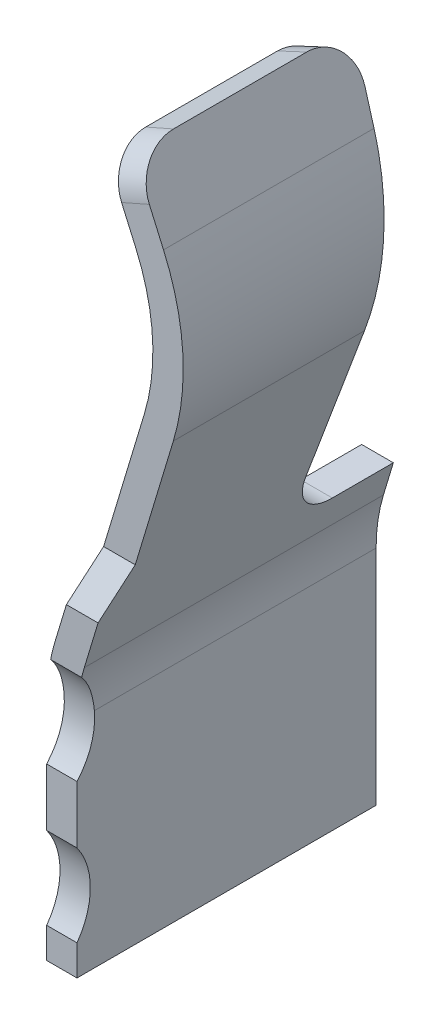
ISO-10303-21;
HEADER;
FILE_DESCRIPTION(('STEP AP214'),'2;1');
FILE_NAME('part.step','',(''),(''),'','','');
FILE_SCHEMA(('AUTOMOTIVE_DESIGN { 1 0 10303 214 1 1 1 1 }'));
ENDSEC;
DATA;
#1=APPLICATION_CONTEXT('core data for automotive mechanical design processes');
#2=APPLICATION_PROTOCOL_DEFINITION('international standard','automotive_design',2000,#1);
#3=PRODUCT_CONTEXT('',#1,'mechanical');
#4=PRODUCT('Part','Part','',(#3));
#5=PRODUCT_RELATED_PRODUCT_CATEGORY('part','',(#4));
#6=PRODUCT_DEFINITION_FORMATION('','',#4);
#7=PRODUCT_DEFINITION_CONTEXT('part definition',#1,'design');
#8=PRODUCT_DEFINITION('design','',#6,#7);
#9=PRODUCT_DEFINITION_SHAPE('','',#8);
#10=(LENGTH_UNIT() NAMED_UNIT(*) SI_UNIT(.MILLI.,.METRE.));
#11=(NAMED_UNIT(*) PLANE_ANGLE_UNIT() SI_UNIT($,.RADIAN.));
#12=(NAMED_UNIT(*) SI_UNIT($,.STERADIAN.) SOLID_ANGLE_UNIT());
#13=UNCERTAINTY_MEASURE_WITH_UNIT(LENGTH_MEASURE(1.E-05),#10,'distance_accuracy_value','');
#14=(GEOMETRIC_REPRESENTATION_CONTEXT(3) GLOBAL_UNCERTAINTY_ASSIGNED_CONTEXT((#13)) GLOBAL_UNIT_ASSIGNED_CONTEXT((#10,
#11,#12)) REPRESENTATION_CONTEXT('',''));
#15=CARTESIAN_POINT('',(0.,0.,0.));
#16=DIRECTION('',(0.,0.,1.));
#17=DIRECTION('',(1.,0.,0.));
#18=AXIS2_PLACEMENT_3D('',#15,#16,#17);
#19=CARTESIAN_POINT('',(10.84386274133,3.53312166947706,-0.236832722369338));
#20=DIRECTION('',(-0.914255270392897,-0.402239697454475,0.0483789866630426));
#21=DIRECTION('',(0.402711251685505,-0.915327071470026,0.));
#22=AXIS2_PLACEMENT_3D('',#19,#20,#21);
#23=CYLINDRICAL_SURFACE('',#22,0.2);
#24=CARTESIAN_POINT('',(10.8303585226747,3.50329761180303,-0.434687053017797));
#25=CARTESIAN_POINT('',(10.7792815955281,3.6193909515076,-0.448650066039084));
#26=CARTESIAN_POINT('',(10.7410128164818,3.70637250294574,-0.363398989614743));
#27=CARTESIAN_POINT('',(10.7410128164818,3.70637250294574,-0.235652283248446));
#28=(BOUNDED_CURVE() B_SPLINE_CURVE(3,(#24,#25,#26,#27),.UNSPECIFIED.,.F.,
.F.) B_SPLINE_CURVE_WITH_KNOTS((4,4),(3.0320715031167,4.71238898038462),
.UNSPECIFIED.) CURVE() GEOMETRIC_REPRESENTATION_ITEM() RATIONAL_B_SPLINE_CURVE((1.,
0.778229742533871,0.778229742533871,1.)) REPRESENTATION_ITEM(''));
#29=CARTESIAN_POINT('',(10.8303585226747,3.50329761180303,-0.434687053017797));
#30=VERTEX_POINT('',#29);
#31=CARTESIAN_POINT('',(10.7410128164818,3.70637250294574,-0.235652283248446));
#32=VERTEX_POINT('',#31);
#33=EDGE_CURVE('E226',#30,#32,#28,.T.);
#34=ORIENTED_EDGE('',*,*,#33,.F.);
#35=DIRECTION('',(0.914255270392898,0.402239697454473,-0.0483789866630426));
#36=VECTOR('',#35,1.);
#37=CARTESIAN_POINT('',(-13.217177596038,-7.07676024092296,0.837819069551529));
#38=LINE('',#37,#36);
#39=CARTESIAN_POINT('',(10.6930594619542,3.44289092405021,-0.427421697659669));
#40=VERTEX_POINT('',#39);
#41=EDGE_CURVE('E11',#40,#30,#38,.T.);
#42=ORIENTED_EDGE('',*,*,#41,.F.);
#43=CARTESIAN_POINT('',(10.6037137557613,3.64596581519291,-0.228386927890318));
#44=CARTESIAN_POINT('',(10.6037137557613,3.64596581519291,-0.356133634256616));
#45=CARTESIAN_POINT('',(10.6419825348076,3.55898426375477,-0.441384710680957));
#46=CARTESIAN_POINT('',(10.6930594619542,3.44289092405021,-0.427421697659669));
#47=(BOUNDED_CURVE() B_SPLINE_CURVE(3,(#43,#44,#45,#46),.UNSPECIFIED.,.F.,
.F.) B_SPLINE_CURVE_WITH_KNOTS((4,4),(1.57079632679495,3.25111380406287),
.UNSPECIFIED.) CURVE() GEOMETRIC_REPRESENTATION_ITEM() RATIONAL_B_SPLINE_CURVE((1.,
0.778229742533869,0.778229742533869,1.)) REPRESENTATION_ITEM(''));
#48=CARTESIAN_POINT('',(10.6037137557613,3.64596581519291,-0.228386927890318));
#49=VERTEX_POINT('',#48);
#50=EDGE_CURVE('E339',#49,#40,#47,.T.);
#51=ORIENTED_EDGE('',*,*,#50,.F.);
#52=DIRECTION('',(-0.914255270392898,-0.402239697454473,0.0483789866630426));
#53=VECTOR('',#52,1.);
#54=CARTESIAN_POINT('',(10.7633204909929,3.71618708377106,-0.236832722369339));
#55=LINE('',#54,#53);
#56=EDGE_CURVE('E308',#32,#49,#55,.T.);
#57=ORIENTED_EDGE('',*,*,#56,.F.);
#58=EDGE_LOOP('',(#34,#42,#51,#57));
#59=FACE_BOUND('',#58,.T.);
#60=ADVANCED_FACE('F16',(#59),#23,.T.);
#61=CARTESIAN_POINT('',(10.8215550668189,3.52330708865174,0.423604352914838));
#62=DIRECTION('',(0.915327071470026,0.402711251685505,0.));
#63=DIRECTION('',(-0.402711251685505,0.915327071470026,0.));
#64=AXIS2_PLACEMENT_3D('',#61,#62,#63);
#65=CYLINDRICAL_SURFACE('',#64,0.2);
#66=CARTESIAN_POINT('',(10.6842560060984,3.46290040089891,0.423604352914837));
#67=DIRECTION('',(-0.915327071470029,-0.402711251685498,0.));
#68=DIRECTION('',(-0.402711251685498,0.915327071470029,0.));
#69=AXIS2_PLACEMENT_3D('',#66,#67,#68);
#70=CIRCLE('',#69,0.2);
#71=CARTESIAN_POINT('',(10.6842560060984,3.46290040089891,0.623604352914837));
#72=VERTEX_POINT('',#71);
#73=CARTESIAN_POINT('',(10.6037137557613,3.64596581519291,0.423604352914837));
#74=VERTEX_POINT('',#73);
#75=EDGE_CURVE('E307',#72,#74,#70,.T.);
#76=ORIENTED_EDGE('',*,*,#75,.F.);
#77=DIRECTION('',(-0.915327071470027,-0.402711251685503,0.));
#78=VECTOR('',#77,1.);
#79=CARTESIAN_POINT('',(-13.9330633966531,-7.36784176638169,0.623604352914803));
#80=LINE('',#79,#78);
#81=CARTESIAN_POINT('',(10.8215550668189,3.52330708865174,0.623604352914837));
#82=VERTEX_POINT('',#81);
#83=EDGE_CURVE('E27',#82,#72,#80,.T.);
#84=ORIENTED_EDGE('',*,*,#83,.F.);
#85=CARTESIAN_POINT('',(10.8215550668189,3.52330708865174,0.423604352914838));
#86=DIRECTION('',(0.915327071470029,0.402711251685498,0.));
#87=DIRECTION('',(0.402711251685498,-0.915327071470029,0.));
#88=AXIS2_PLACEMENT_3D('',#85,#86,#87);
#89=CIRCLE('',#88,0.2);
#90=CARTESIAN_POINT('',(10.7410128164818,3.70637250294574,0.423604352914837));
#91=VERTEX_POINT('',#90);
#92=EDGE_CURVE('E276',#91,#82,#89,.T.);
#93=ORIENTED_EDGE('',*,*,#92,.F.);
#94=DIRECTION('',(0.915327071470027,0.402711251685503,0.));
#95=VECTOR('',#94,1.);
#96=CARTESIAN_POINT('',(10.7410128164818,3.70637250294574,0.423604352914837));
#97=LINE('',#96,#95);
#98=EDGE_CURVE('E331',#74,#91,#97,.T.);
#99=ORIENTED_EDGE('',*,*,#98,.F.);
#100=EDGE_LOOP('',(#76,#84,#93,#99));
#101=FACE_BOUND('',#100,.T.);
#102=ADVANCED_FACE('F377',(#101),#65,.T.);
#103=CARTESIAN_POINT('',(-18.03,1.65634067151207,-0.212546111318104));
#104=DIRECTION('',(0.,-1.,0.));
#105=DIRECTION('',(0.,0.,-1.));
#106=AXIS2_PLACEMENT_3D('',#103,#104,#105);
#107=PLANE('',#106);
#108=DIRECTION('',(0.,0.,-1.));
#109=VECTOR('',#108,1.);
#110=CARTESIAN_POINT('',(10.5084965908944,1.65634067151207,-0.740000000000021));
#111=LINE('',#110,#109);
#112=CARTESIAN_POINT('',(10.5084965908944,1.65634067151207,-0.438042305987955));
#113=VERTEX_POINT('',#112);
#114=CARTESIAN_POINT('',(10.5084965908944,1.65634067151207,-0.740000000000021));
#115=VERTEX_POINT('',#114);
#116=EDGE_CURVE('E330',#113,#115,#111,.T.);
#117=ORIENTED_EDGE('',*,*,#116,.F.);
#118=DIRECTION('',(1.,0.,0.));
#119=VECTOR('',#118,1.);
#120=CARTESIAN_POINT('',(10.6651649210584,1.65634067151207,-0.438042305987954));
#121=LINE('',#120,#119);
#122=CARTESIAN_POINT('',(10.6651649210585,1.65634067151207,-0.438042305987954));
#123=VERTEX_POINT('',#122);
#124=EDGE_CURVE('E298',#113,#123,#121,.T.);
#125=ORIENTED_EDGE('',*,*,#124,.T.);
#126=DIRECTION('',(0.,0.,1.));
#127=VECTOR('',#126,1.);
#128=CARTESIAN_POINT('',(10.6651649210585,1.65634067151207,-0.74000000000002));
#129=LINE('',#128,#127);
#130=CARTESIAN_POINT('',(10.6651649210585,1.65634067151207,-0.74000000000002));
#131=VERTEX_POINT('',#130);
#132=EDGE_CURVE('E548',#131,#123,#129,.T.);
#133=ORIENTED_EDGE('',*,*,#132,.F.);
#134=DIRECTION('',(-1.,0.,0.));
#135=VECTOR('',#134,1.);
#136=CARTESIAN_POINT('',(11.43,1.65634067151207,-0.740000000000019));
#137=LINE('',#136,#135);
#138=EDGE_CURVE('E491',#131,#115,#137,.T.);
#139=ORIENTED_EDGE('',*,*,#138,.T.);
#140=EDGE_LOOP('',(#117,#125,#133,#139));
#141=FACE_BOUND('',#140,.T.);
#142=ADVANCED_FACE('F380',(#141),#107,.F.);
#143=CARTESIAN_POINT('',(-18.03,3.70637250294571,-0.459111687165995));
#144=DIRECTION('',(0.,0.119413416546905,0.992844618230162));
#145=DIRECTION('',(1.,0.,0.));
#146=AXIS2_PLACEMENT_3D('',#143,#144,#145);
#147=PLANE('',#146);
#148=DIRECTION('',(0.286748539926818,0.951150986717315,-0.11439875574724));
#149=VECTOR('',#148,1.);
#150=CARTESIAN_POINT('',(10.6341223648881,1.55337185451571,-0.200161637444148));
#151=LINE('',#150,#149);
#152=CARTESIAN_POINT('',(10.7326600227304,1.88022335482146,-0.239473382341922));
#153=VERTEX_POINT('',#152);
#154=CARTESIAN_POINT('',(10.9402017604538,2.56864369924933,-0.322272466749581));
#155=VERTEX_POINT('',#154);
#156=EDGE_CURVE('E317',#153,#155,#151,.T.);
#157=ORIENTED_EDGE('',*,*,#156,.F.);
#158=DIRECTION('',(-1.,0.,0.));
#159=VECTOR('',#158,1.);
#160=CARTESIAN_POINT('',(10.5084965908944,1.88022335482146,-0.239473382341922));
#161=LINE('',#160,#159);
#162=CARTESIAN_POINT('',(10.5759916925664,1.88022335482146,-0.239473382341922));
#163=VERTEX_POINT('',#162);
#164=EDGE_CURVE('E345',#153,#163,#161,.T.);
#165=ORIENTED_EDGE('',*,*,#164,.T.);
#166=DIRECTION('',(-0.28674853992682,-0.951150986717314,0.11439875574724));
#167=VECTOR('',#166,1.);
#168=CARTESIAN_POINT('',(10.4903360451115,1.59610175610151,-0.205300934614505));
#169=LINE('',#168,#167);
#170=CARTESIAN_POINT('',(10.7965862640963,2.61194022573825,-0.327479914176623));
#171=VERTEX_POINT('',#170);
#172=EDGE_CURVE('E257',#171,#163,#169,.T.);
#173=ORIENTED_EDGE('',*,*,#172,.F.);
#174=CARTESIAN_POINT('',(10.7544766931834,3.30329498734983,-0.410631932744419));
#175=CARTESIAN_POINT('',(10.8514549897076,3.08287189317973,-0.384120760424612));
#176=CARTESIAN_POINT('',(10.8660955111766,2.84250387207174,-0.355210731501567));
#177=CARTESIAN_POINT('',(10.7965862640963,2.61194022573825,-0.327479914176623));
#178=(BOUNDED_CURVE() B_SPLINE_CURVE(3,(#174,#175,#176,#177),.UNSPECIFIED.,.F.,
.F.) B_SPLINE_CURVE_WITH_KNOTS((4,4),(4.29791199977039,5.00519872138853),
.UNSPECIFIED.) CURVE() GEOMETRIC_REPRESENTATION_ITEM() RATIONAL_B_SPLINE_CURVE((1.,
0.958744787021091,0.958744787021091,1.)) REPRESENTATION_ITEM(''));
#179=CARTESIAN_POINT('',(10.7544766931834,3.30329498734983,-0.410631932744419));
#180=VERTEX_POINT('',#179);
#181=EDGE_CURVE('E288',#180,#171,#178,.T.);
#182=ORIENTED_EDGE('',*,*,#181,.F.);
#183=DIRECTION('',(0.400292818236851,-0.909830186054405,0.109428936813833));
#184=VECTOR('',#183,1.);
#185=CARTESIAN_POINT('',(10.7400491803441,3.33608744850051,-0.414576013974334));
#186=LINE('',#185,#184);
#187=EDGE_CURVE('E334',#40,#180,#186,.T.);
#188=ORIENTED_EDGE('',*,*,#187,.F.);
#189=ORIENTED_EDGE('',*,*,#41,.T.);
#190=DIRECTION('',(-0.40029281823685,0.909830186054405,-0.109428936813833));
#191=VECTOR('',#190,1.);
#192=CARTESIAN_POINT('',(10.8776664899118,3.39577078475993,-0.421754368938235));
#193=LINE('',#192,#191);
#194=CARTESIAN_POINT('',(10.8917757539039,3.36370167510267,-0.417897288102547));
#195=VERTEX_POINT('',#194);
#196=EDGE_CURVE('E217',#195,#30,#193,.T.);
#197=ORIENTED_EDGE('',*,*,#196,.F.);
#198=CARTESIAN_POINT('',(10.9402017604538,2.56864369924933,-0.322272466749581));
#199=CARTESIAN_POINT('',(11.020137394596,2.83379189253285,-0.354162906673267));
#200=CARTESIAN_POINT('',(11.0033007949067,3.11021511680704,-0.387409439934769));
#201=CARTESIAN_POINT('',(10.8917757539039,3.36370167510267,-0.417897288102547));
#202=(BOUNDED_CURVE() B_SPLINE_CURVE(3,(#198,#199,#200,#201),.UNSPECIFIED.,.F.,
.F.) B_SPLINE_CURVE_WITH_KNOTS((4,4),(1.27798658579106,1.98527330740919),
.UNSPECIFIED.) CURVE() GEOMETRIC_REPRESENTATION_ITEM() RATIONAL_B_SPLINE_CURVE((1.,
0.958744787021091,0.958744787021091,1.)) REPRESENTATION_ITEM(''));
#203=EDGE_CURVE('E221',#155,#195,#202,.T.);
#204=ORIENTED_EDGE('',*,*,#203,.F.);
#205=EDGE_LOOP('',(#157,#165,#173,#182,#188,#189,#197,#204));
#206=FACE_BOUND('',#205,.T.);
#207=ADVANCED_FACE('F219',(#206),#147,.F.);
#208=CARTESIAN_POINT('',(-18.03,1.94413292378283,0.623604352914797));
#209=DIRECTION('',(0.,0.,-1.));
#210=DIRECTION('',(0.,-1.,0.));
#211=AXIS2_PLACEMENT_3D('',#208,#209,#210);
#212=PLANE('',#211);
#213=DIRECTION('',(0.4027112516855,-0.915327071470028,0.));
#214=VECTOR('',#213,1.);
#215=CARTESIAN_POINT('',(10.8917757539039,3.36370167510267,0.623604352914838));
#216=LINE('',#215,#214);
#217=CARTESIAN_POINT('',(10.8917757539039,3.36370167510267,0.623604352914838));
#218=VERTEX_POINT('',#217);
#219=EDGE_CURVE('E227',#82,#218,#216,.T.);
#220=ORIENTED_EDGE('',*,*,#219,.F.);
#221=ORIENTED_EDGE('',*,*,#83,.T.);
#222=DIRECTION('',(-0.402711251685501,0.915327071470028,0.));
#223=VECTOR('',#222,1.);
#224=CARTESIAN_POINT('',(10.7544766931834,3.30329498734984,0.623604352914837));
#225=LINE('',#224,#223);
#226=CARTESIAN_POINT('',(10.7544766931834,3.30329498734983,0.623604352914837));
#227=VERTEX_POINT('',#226);
#228=EDGE_CURVE('E300',#227,#72,#225,.T.);
#229=ORIENTED_EDGE('',*,*,#228,.F.);
#230=CARTESIAN_POINT('',(9.83914962171338,2.90058373566433,0.623604352914836));
#231=DIRECTION('',(0.,0.,1.));
#232=DIRECTION('',(-1.,0.,0.));
#233=AXIS2_PLACEMENT_3D('',#230,#231,#232);
#234=CIRCLE('',#233,1.);
#235=CARTESIAN_POINT('',(10.7965862640963,2.61194022573825,0.623604352914837));
#236=VERTEX_POINT('',#235);
#237=EDGE_CURVE('E287',#236,#227,#234,.T.);
#238=ORIENTED_EDGE('',*,*,#237,.F.);
#239=DIRECTION('',(0.28864350992609,0.957436642382956,0.));
#240=VECTOR('',#239,1.);
#241=CARTESIAN_POINT('',(10.472563357617,1.53714937485737,0.623604352914836));
#242=LINE('',#241,#240);
#243=CARTESIAN_POINT('',(10.5952588497716,1.94413292378283,0.623604352914837));
#244=VERTEX_POINT('',#243);
#245=EDGE_CURVE('E313',#244,#236,#242,.T.);
#246=ORIENTED_EDGE('',*,*,#245,.F.);
#247=DIRECTION('',(1.,0.,0.));
#248=VECTOR('',#247,1.);
#249=CARTESIAN_POINT('',(-18.03,1.94413292378283,0.623604352914797));
#250=LINE('',#249,#248);
#251=CARTESIAN_POINT('',(10.7519271799357,1.94413292378283,0.623604352914837));
#252=VERTEX_POINT('',#251);
#253=EDGE_CURVE('E500',#244,#252,#250,.T.);
#254=ORIENTED_EDGE('',*,*,#253,.T.);
#255=DIRECTION('',(-0.288643509926088,-0.957436642382956,0.));
#256=VECTOR('',#255,1.);
#257=CARTESIAN_POINT('',(10.6161788539745,1.49385284836845,0.623604352914837));
#258=LINE('',#257,#256);
#259=CARTESIAN_POINT('',(10.9402017604538,2.56864369924933,0.623604352914837));
#260=VERTEX_POINT('',#259);
#261=EDGE_CURVE('E251',#260,#252,#258,.T.);
#262=ORIENTED_EDGE('',*,*,#261,.F.);
#263=CARTESIAN_POINT('',(9.83914962171338,2.90058373566433,0.623604352914836));
#264=DIRECTION('',(0.,0.,-1.));
#265=DIRECTION('',(-1.,0.,0.));
#266=AXIS2_PLACEMENT_3D('',#263,#264,#265);
#267=CIRCLE('',#266,1.15);
#268=EDGE_CURVE('E237',#218,#260,#267,.T.);
#269=ORIENTED_EDGE('',*,*,#268,.F.);
#270=EDGE_LOOP('',(#220,#221,#229,#238,#246,#254,#262,#269));
#271=FACE_BOUND('',#270,.T.);
#272=ADVANCED_FACE('F878',(#271),#212,.F.);
#273=CARTESIAN_POINT('',(-18.03,1.7003498353216,0.749999999999972));
#274=DIRECTION('',(0.,-0.460287319631494,-0.887770005906065));
#275=DIRECTION('',(0.,-0.887770005906065,0.460287319631494));
#276=AXIS2_PLACEMENT_3D('',#273,#274,#275);
#277=PLANE('',#276);
#278=ORIENTED_EDGE('',*,*,#253,.F.);
#279=DIRECTION('',(0.258541028225373,0.857586072334425,-0.444637678635293));
#280=VECTOR('',#279,1.);
#281=CARTESIAN_POINT('',(10.6535765616936,2.13757401070795,0.523309818502746));
#282=LINE('',#281,#280);
#283=CARTESIAN_POINT('',(10.5275789123207,1.7196371362757,0.73999999999998));
#284=VERTEX_POINT('',#283);
#285=EDGE_CURVE('E309',#284,#244,#282,.T.);
#286=ORIENTED_EDGE('',*,*,#285,.F.);
#287=DIRECTION('',(-1.,0.,0.));
#288=VECTOR('',#287,1.);
#289=CARTESIAN_POINT('',(11.43,1.7196371362757,0.739999999999981));
#290=LINE('',#289,#288);
#291=CARTESIAN_POINT('',(10.6842472424848,1.7196371362757,0.73999999999998));
#292=VERTEX_POINT('',#291);
#293=EDGE_CURVE('E469',#292,#284,#290,.T.);
#294=ORIENTED_EDGE('',*,*,#293,.F.);
#295=DIRECTION('',(-0.258541028225372,-0.857586072334425,0.444637678635293));
#296=VECTOR('',#295,1.);
#297=CARTESIAN_POINT('',(10.7997726380838,2.10283732290249,0.541319952677682));
#298=LINE('',#297,#296);
#299=EDGE_CURVE('E244',#252,#292,#298,.T.);
#300=ORIENTED_EDGE('',*,*,#299,.F.);
#301=EDGE_LOOP('',(#278,#286,#294,#300));
#302=FACE_BOUND('',#301,.T.);
#303=ADVANCED_FACE('F869',(#302),#277,.F.);
#304=CARTESIAN_POINT('',(11.43,1.24850586493128,0.739999999999981));
#305=DIRECTION('',(0.,0.,-1.));
#306=DIRECTION('',(0.,-1.,0.));
#307=AXIS2_PLACEMENT_3D('',#304,#305,#306);
#308=PLANE('',#307);
#309=DIRECTION('',(0.,1.,0.));
#310=VECTOR('',#309,1.);
#311=CARTESIAN_POINT('',(10.58,0.145965815192914,0.73999999999998));
#312=LINE('',#311,#310);
#313=CARTESIAN_POINT('',(10.58,0.145965815192914,0.73999999999998));
#314=VERTEX_POINT('',#313);
#315=CARTESIAN_POINT('',(10.58,0.296740599868486,0.73999999999998));
#316=VERTEX_POINT('',#315);
#317=EDGE_CURVE('E198',#314,#316,#312,.T.);
#318=ORIENTED_EDGE('',*,*,#317,.T.);
#319=DIRECTION('',(-1.,0.,0.));
#320=VECTOR('',#319,1.);
#321=CARTESIAN_POINT('',(-18.03,0.296740599868486,0.73999999999994));
#322=LINE('',#321,#320);
#323=CARTESIAN_POINT('',(10.43,0.296740599868486,0.739999999999979));
#324=VERTEX_POINT('',#323);
#325=EDGE_CURVE('E584',#316,#324,#322,.T.);
#326=ORIENTED_EDGE('',*,*,#325,.T.);
#327=DIRECTION('',(0.,-1.,0.));
#328=VECTOR('',#327,1.);
#329=CARTESIAN_POINT('',(10.43,0.145965815192914,0.739999999999979));
#330=LINE('',#329,#328);
#331=CARTESIAN_POINT('',(10.43,0.145965815192914,0.739999999999979));
#332=VERTEX_POINT('',#331);
#333=EDGE_CURVE('E488',#324,#332,#330,.T.);
#334=ORIENTED_EDGE('',*,*,#333,.T.);
#335=DIRECTION('',(1.,0.,0.));
#336=VECTOR('',#335,1.);
#337=CARTESIAN_POINT('',(10.58,0.145965815192914,0.73999999999998));
#338=LINE('',#337,#336);
#339=EDGE_CURVE('E496',#332,#314,#338,.T.);
#340=ORIENTED_EDGE('',*,*,#339,.T.);
#341=EDGE_LOOP('',(#318,#326,#334,#340));
#342=FACE_BOUND('',#341,.T.);
#343=ADVANCED_FACE('F864',(#342),#308,.F.);
#344=CARTESIAN_POINT('',(11.43,1.24850586493128,-0.740000000000019));
#345=DIRECTION('',(0.,0.,-1.));
#346=DIRECTION('',(0.,-1.,0.));
#347=AXIS2_PLACEMENT_3D('',#344,#345,#346);
#348=PLANE('',#347);
#349=ORIENTED_EDGE('',*,*,#138,.F.);
#350=DIRECTION('',(0.288643509926088,0.957436642382956,0.));
#351=VECTOR('',#350,1.);
#352=CARTESIAN_POINT('',(10.6161788539745,1.49385284836845,-0.74000000000002));
#353=LINE('',#352,#351);
#354=CARTESIAN_POINT('',(10.6161788539745,1.49385284836845,-0.74000000000002));
#355=VERTEX_POINT('',#354);
#356=EDGE_CURVE('E542',#355,#131,#353,.T.);
#357=ORIENTED_EDGE('',*,*,#356,.F.);
#358=CARTESIAN_POINT('',(11.43,1.24850586493128,-0.740000000000019));
#359=DIRECTION('',(0.,0.,-1.));
#360=DIRECTION('',(1.,0.,0.));
#361=AXIS2_PLACEMENT_3D('',#358,#359,#360);
#362=CIRCLE('',#361,0.85);
#363=CARTESIAN_POINT('',(10.58,1.24850586493128,-0.74000000000002));
#364=VERTEX_POINT('',#363);
#365=EDGE_CURVE('E516',#364,#355,#362,.T.);
#366=ORIENTED_EDGE('',*,*,#365,.F.);
#367=DIRECTION('',(0.,1.,0.));
#368=VECTOR('',#367,1.);
#369=CARTESIAN_POINT('',(10.58,0.145965815192914,-0.74000000000002));
#370=LINE('',#369,#368);
#371=CARTESIAN_POINT('',(10.58,0.145965815192914,-0.74000000000002));
#372=VERTEX_POINT('',#371);
#373=EDGE_CURVE('E271',#372,#364,#370,.T.);
#374=ORIENTED_EDGE('',*,*,#373,.F.);
#375=DIRECTION('',(1.,0.,0.));
#376=VECTOR('',#375,1.);
#377=CARTESIAN_POINT('',(10.58,0.145965815192914,-0.74000000000002));
#378=LINE('',#377,#376);
#379=CARTESIAN_POINT('',(10.43,0.145965815192914,-0.740000000000021));
#380=VERTEX_POINT('',#379);
#381=EDGE_CURVE('E495',#380,#372,#378,.T.);
#382=ORIENTED_EDGE('',*,*,#381,.F.);
#383=DIRECTION('',(0.,-1.,0.));
#384=VECTOR('',#383,1.);
#385=CARTESIAN_POINT('',(10.43,0.145965815192914,-0.740000000000021));
#386=LINE('',#385,#384);
#387=CARTESIAN_POINT('',(10.43,1.24850586493128,-0.740000000000021));
#388=VERTEX_POINT('',#387);
#389=EDGE_CURVE('E42',#388,#380,#386,.T.);
#390=ORIENTED_EDGE('',*,*,#389,.F.);
#391=CARTESIAN_POINT('',(11.43,1.24850586493128,-0.740000000000019));
#392=DIRECTION('',(0.,0.,1.));
#393=DIRECTION('',(1.,0.,0.));
#394=AXIS2_PLACEMENT_3D('',#391,#392,#393);
#395=CIRCLE('',#394,1.);
#396=CARTESIAN_POINT('',(10.472563357617,1.53714937485737,-0.740000000000021));
#397=VERTEX_POINT('',#396);
#398=EDGE_CURVE('E289',#397,#388,#395,.T.);
#399=ORIENTED_EDGE('',*,*,#398,.F.);
#400=DIRECTION('',(-0.28864350992609,-0.957436642382956,0.));
#401=VECTOR('',#400,1.);
#402=CARTESIAN_POINT('',(10.472563357617,1.53714937485737,-0.740000000000021));
#403=LINE('',#402,#401);
#404=EDGE_CURVE('E323',#115,#397,#403,.T.);
#405=ORIENTED_EDGE('',*,*,#404,.F.);
#406=EDGE_LOOP('',(#349,#357,#366,#374,#382,#390,#399,#405));
#407=FACE_BOUND('',#406,.T.);
#408=ADVANCED_FACE('F868',(#407),#348,.T.);
#409=CARTESIAN_POINT('',(10.43,0.145965815192914,-0.740000000000021));
#410=DIRECTION('',(1.,0.,0.));
#411=DIRECTION('',(0.,1.,0.));
#412=AXIS2_PLACEMENT_3D('',#409,#410,#411);
#413=PLANE('',#412);
#414=DIRECTION('',(0.,-1.,0.));
#415=VECTOR('',#414,1.);
#416=CARTESIAN_POINT('',(10.43,0.145965815192914,0.739999999999979));
#417=LINE('',#416,#415);
#418=CARTESIAN_POINT('',(10.43,0.988055123608201,0.739999999999979));
#419=VERTEX_POINT('',#418);
#420=CARTESIAN_POINT('',(10.43,0.703259400131467,0.739999999999979));
#421=VERTEX_POINT('',#420);
#422=EDGE_CURVE('E506',#419,#421,#417,.T.);
#423=ORIENTED_EDGE('',*,*,#422,.F.);
#424=CARTESIAN_POINT('',(10.43,1.21669179396546,0.995153761033096));
#425=DIRECTION('',(1.,0.,0.));
#426=DIRECTION('',(0.,1.,0.));
#427=AXIS2_PLACEMENT_3D('',#424,#425,#426);
#428=CIRCLE('',#427,0.342604974863759);
#429=CARTESIAN_POINT('',(10.43,1.24850586493128,0.654029100989324));
#430=VERTEX_POINT('',#429);
#431=EDGE_CURVE('E455',#419,#430,#428,.T.);
#432=ORIENTED_EDGE('',*,*,#431,.T.);
#433=DIRECTION('',(0.,0.,1.));
#434=VECTOR('',#433,1.);
#435=CARTESIAN_POINT('',(10.43,1.24850586493128,-0.740000000000021));
#436=LINE('',#435,#434);
#437=EDGE_CURVE('E292',#388,#430,#436,.T.);
#438=ORIENTED_EDGE('',*,*,#437,.F.);
#439=ORIENTED_EDGE('',*,*,#389,.T.);
#440=DIRECTION('',(0.,0.,1.));
#441=VECTOR('',#440,1.);
#442=CARTESIAN_POINT('',(10.43,0.145965815192914,-0.740000000000021));
#443=LINE('',#442,#441);
#444=EDGE_CURVE('E492',#380,#332,#443,.T.);
#445=ORIENTED_EDGE('',*,*,#444,.T.);
#446=ORIENTED_EDGE('',*,*,#333,.F.);
#447=CARTESIAN_POINT('',(10.43,0.499999999999977,1.0194268345702));
#448=DIRECTION('',(1.,0.,0.));
#449=DIRECTION('',(0.,1.,0.));
#450=AXIS2_PLACEMENT_3D('',#447,#448,#449);
#451=CIRCLE('',#450,0.345533991988848);
#452=EDGE_CURVE('E589',#324,#421,#451,.T.);
#453=ORIENTED_EDGE('',*,*,#452,.T.);
#454=EDGE_LOOP('',(#423,#432,#438,#439,#445,#446,#453));
#455=FACE_BOUND('',#454,.T.);
#456=ADVANCED_FACE('F373',(#455),#413,.F.);
#457=CARTESIAN_POINT('',(11.43,1.24850586493128,-0.740000000000019));
#458=DIRECTION('',(0.,0.,1.));
#459=DIRECTION('',(-1.,0.,0.));
#460=AXIS2_PLACEMENT_3D('',#457,#458,#459);
#461=CYLINDRICAL_SURFACE('',#460,1.);
#462=ORIENTED_EDGE('',*,*,#437,.T.);
#463=CARTESIAN_POINT('',(10.43,1.24850586493127,0.654029100989324));
#464=CARTESIAN_POINT('',(10.4299999259264,1.25306932177748,0.654454497923835));
#465=CARTESIAN_POINT('',(10.4300312352786,1.25762446546712,0.654969794425774));
#466=CARTESIAN_POINT('',(10.4301551650957,1.26669234380872,0.656178662703507));
#467=CARTESIAN_POINT('',(10.430247549203,1.27120517419842,0.656871540938563));
#468=CARTESIAN_POINT('',(10.4304919132932,1.28018764830056,0.658435530000101));
#469=CARTESIAN_POINT('',(10.4306437571039,1.28465736694881,0.659306231418194));
#470=CARTESIAN_POINT('',(10.431005222969,1.29355289226453,0.661225514697385));
#471=CARTESIAN_POINT('',(10.4312148055409,1.29797872680563,0.66227397481712));
#472=CARTESIAN_POINT('',(10.4316899720729,1.30678583476397,0.664548502475786));
#473=CARTESIAN_POINT('',(10.431955607474,1.31116706334694,0.665774732832754));
#474=CARTESIAN_POINT('',(10.4325411084712,1.31988437499395,0.668404514864849));
#475=CARTESIAN_POINT('',(10.4328611090054,1.32422031651338,0.669808505488944));
#476=CARTESIAN_POINT('',(10.4335535893038,1.33284654509273,0.672793524574298));
#477=CARTESIAN_POINT('',(10.4339262786269,1.33713657245114,0.67437525453736));
#478=CARTESIAN_POINT('',(10.4347223975815,1.34567049059148,0.677715533217567));
#479=CARTESIAN_POINT('',(10.435146101327,1.34991398511754,0.679475028174295));
#480=CARTESIAN_POINT('',(10.4360367815061,1.35830019523904,0.683146652073494));
#481=CARTESIAN_POINT('',(10.4365034928044,1.36244335249443,0.6850578369075));
#482=CARTESIAN_POINT('',(10.437476871398,1.37063194178074,0.689033531510101));
#483=CARTESIAN_POINT('',(10.4379833878834,1.3746776733665,0.691097460992356));
#484=CARTESIAN_POINT('',(10.4390328683176,1.38267128376232,0.695378434355306));
#485=CARTESIAN_POINT('',(10.4395757526474,1.3866193519919,0.697595144046891));
#486=CARTESIAN_POINT('',(10.4406945570178,1.39441764648526,0.702181418874192));
#487=CARTESIAN_POINT('',(10.4412704570056,1.39826793013232,0.704550891332613));
#488=CARTESIAN_POINT('',(10.442451970372,1.40587073759695,0.709442454924468));
#489=CARTESIAN_POINT('',(10.4430576108172,1.40962316741917,0.71196468558873));
#490=CARTESIAN_POINT('',(10.4442953792637,1.4170304504751,0.717161525963166));
#491=CARTESIAN_POINT('',(10.444927568527,1.42068504210779,0.719836493879692));
#492=CARTESIAN_POINT('',(10.4462152934578,1.42789683764576,0.725338623347789));
#493=CARTESIAN_POINT('',(10.4468709115293,1.43145359950846,0.728166344681211));
#494=CARTESIAN_POINT('',(10.4482024840542,1.43847023752972,0.733973670299353));
#495=CARTESIAN_POINT('',(10.448878529499,1.44192948379825,0.736954014976151));
#496=CARTESIAN_POINT('',(10.4495608818653,1.44532846432271,0.73999999999998));
#497=B_SPLINE_CURVE_WITH_KNOTS('',3,(#463,#464,#465,#466,#467,#468,#469,#470,#471,#472,#473,
#474,#475,#476,#477,#478,#479,#480,#481,#482,#483,#484,#485,#486,#487,#488,#489,#490,#491,#492,
#493,#494,#495,#496),.UNSPECIFIED.,.F.,.F.,(4,2,2,2,2,2,2,2,2,2,2,2,2,2,2,2,4),(0.,
0.013748827736232,0.0274447569667543,0.0411095020469267,0.0547649260984996,0.0684329369744623,
0.0821353821572885,0.0958939450956066,0.109730045405059,0.123485924962942,0.137191991355335,
0.150868974599206,0.164537737053089,0.17821917870054,0.191934141578146,0.205703315519925,
0.219547147320743),.UNSPECIFIED.);
#498=CARTESIAN_POINT('',(10.4495608818653,1.44532846432271,0.739999999999979));
#499=VERTEX_POINT('',#498);
#500=EDGE_CURVE('E355',#430,#499,#497,.T.);
#501=ORIENTED_EDGE('',*,*,#500,.T.);
#502=CARTESIAN_POINT('',(11.43,1.24850586493128,0.739999999999981));
#503=DIRECTION('',(0.,0.,1.));
#504=DIRECTION('',(1.,0.,0.));
#505=AXIS2_PLACEMENT_3D('',#502,#503,#504);
#506=CIRCLE('',#505,1.);
#507=CARTESIAN_POINT('',(10.472563357617,1.53714937485737,0.739999999999979));
#508=VERTEX_POINT('',#507);
#509=EDGE_CURVE('E432',#508,#499,#506,.T.);
#510=ORIENTED_EDGE('',*,*,#509,.F.);
#511=DIRECTION('',(0.,0.,1.));
#512=VECTOR('',#511,1.);
#513=CARTESIAN_POINT('',(10.472563357617,1.53714937485737,-0.740000000000021));
#514=LINE('',#513,#512);
#515=EDGE_CURVE('E314',#397,#508,#514,.T.);
#516=ORIENTED_EDGE('',*,*,#515,.F.);
#517=ORIENTED_EDGE('',*,*,#398,.T.);
#518=EDGE_LOOP('',(#462,#501,#510,#516,#517));
#519=FACE_BOUND('',#518,.T.);
#520=ADVANCED_FACE('F362',(#519),#461,.T.);
#521=CARTESIAN_POINT('',(10.472563357617,1.53714937485737,-0.740000000000021));
#522=DIRECTION('',(0.957436642382956,-0.28864350992609,0.));
#523=DIRECTION('',(0.,0.,-1.));
#524=AXIS2_PLACEMENT_3D('',#521,#522,#523);
#525=PLANE('',#524);
#526=ORIENTED_EDGE('',*,*,#172,.T.);
#527=CARTESIAN_POINT('',(10.5759916925664,1.88022335482146,-0.239473382341922));
#528=CARTESIAN_POINT('',(10.5736017257013,1.87229578405696,-0.238519901512672));
#529=CARTESIAN_POINT('',(10.5711988444155,1.86432537588468,-0.238042305987954));
#530=CARTESIAN_POINT('',(10.5687916531782,1.85634067151208,-0.238042305987954));
#531=(BOUNDED_CURVE() B_SPLINE_CURVE(3,(#527,#528,#529,#530),.UNSPECIFIED.,.F.,
.F.) B_SPLINE_CURVE_WITH_KNOTS((4,4),(4.59268992994791,4.71238898038469),
.UNSPECIFIED.) CURVE() GEOMETRIC_REPRESENTATION_ITEM() RATIONAL_B_SPLINE_CURVE((1.,
0.998806367803328,0.998806367803328,1.)) REPRESENTATION_ITEM(''));
#532=CARTESIAN_POINT('',(10.5687916531782,1.85634067151208,-0.238042305987954));
#533=VERTEX_POINT('',#532);
#534=EDGE_CURVE('E340',#163,#533,#531,.T.);
#535=ORIENTED_EDGE('',*,*,#534,.T.);
#536=CARTESIAN_POINT('',(10.5687916531782,1.85634067151208,-0.238042305987954));
#537=CARTESIAN_POINT('',(10.5334716234365,1.73918338398669,-0.238042305987954));
#538=CARTESIAN_POINT('',(10.5084965908944,1.65634067151208,-0.320885018462573));
#539=CARTESIAN_POINT('',(10.5084965908944,1.65634067151207,-0.438042305987955));
#540=(BOUNDED_CURVE() B_SPLINE_CURVE(3,(#536,#537,#538,#539),.UNSPECIFIED.,.F.,
.F.) B_SPLINE_CURVE_WITH_KNOTS((4,4),(4.71238898038469,6.28318530717959),
.UNSPECIFIED.) CURVE() GEOMETRIC_REPRESENTATION_ITEM() RATIONAL_B_SPLINE_CURVE((1.,
0.804737854124365,0.804737854124365,1.)) REPRESENTATION_ITEM(''));
#541=EDGE_CURVE('E346',#533,#113,#540,.T.);
#542=ORIENTED_EDGE('',*,*,#541,.T.);
#543=ORIENTED_EDGE('',*,*,#116,.T.);
#544=ORIENTED_EDGE('',*,*,#404,.T.);
#545=ORIENTED_EDGE('',*,*,#515,.T.);
#546=DIRECTION('',(-0.28864350992609,-0.957436642382956,0.));
#547=VECTOR('',#546,1.);
#548=CARTESIAN_POINT('',(10.472563357617,1.53714937485737,0.739999999999979));
#549=LINE('',#548,#547);
#550=EDGE_CURVE('E568',#284,#508,#549,.T.);
#551=ORIENTED_EDGE('',*,*,#550,.F.);
#552=ORIENTED_EDGE('',*,*,#285,.T.);
#553=ORIENTED_EDGE('',*,*,#245,.T.);
#554=DIRECTION('',(0.,0.,1.));
#555=VECTOR('',#554,1.);
#556=CARTESIAN_POINT('',(10.7965862640963,2.61194022573825,-0.74000000000002));
#557=LINE('',#556,#555);
#558=EDGE_CURVE('E283',#171,#236,#557,.T.);
#559=ORIENTED_EDGE('',*,*,#558,.F.);
#560=EDGE_LOOP('',(#526,#535,#542,#543,#544,#545,#551,#552,#553,#559));
#561=FACE_BOUND('',#560,.T.);
#562=ADVANCED_FACE('F372',(#561),#525,.F.);
#563=CARTESIAN_POINT('',(9.83914962171338,2.90058373566433,-0.740000000000021));
#564=DIRECTION('',(0.,0.,1.));
#565=DIRECTION('',(-1.,0.,0.));
#566=AXIS2_PLACEMENT_3D('',#563,#564,#565);
#567=CYLINDRICAL_SURFACE('',#566,1.);
#568=DIRECTION('',(0.,0.,1.));
#569=VECTOR('',#568,1.);
#570=CARTESIAN_POINT('',(10.7544766931834,3.30329498734983,-0.74000000000002));
#571=LINE('',#570,#569);
#572=EDGE_CURVE('E338',#180,#227,#571,.T.);
#573=ORIENTED_EDGE('',*,*,#572,.F.);
#574=ORIENTED_EDGE('',*,*,#181,.T.);
#575=ORIENTED_EDGE('',*,*,#558,.T.);
#576=ORIENTED_EDGE('',*,*,#237,.T.);
#577=EDGE_LOOP('',(#573,#574,#575,#576));
#578=FACE_BOUND('',#577,.T.);
#579=ADVANCED_FACE('F645',(#578),#567,.F.);
#580=CARTESIAN_POINT('',(10.7544766931834,3.30329498734984,-0.74000000000002));
#581=DIRECTION('',(0.915327071470028,0.402711251685501,0.));
#582=DIRECTION('',(0.,0.,-1.));
#583=AXIS2_PLACEMENT_3D('',#580,#581,#582);
#584=PLANE('',#583);
#585=ORIENTED_EDGE('',*,*,#228,.T.);
#586=ORIENTED_EDGE('',*,*,#75,.T.);
#587=DIRECTION('',(0.,0.,1.));
#588=VECTOR('',#587,1.);
#589=CARTESIAN_POINT('',(10.6037137557613,3.64596581519291,-0.740000000000021));
#590=LINE('',#589,#588);
#591=EDGE_CURVE('E265',#49,#74,#590,.T.);
#592=ORIENTED_EDGE('',*,*,#591,.F.);
#593=ORIENTED_EDGE('',*,*,#50,.T.);
#594=ORIENTED_EDGE('',*,*,#187,.T.);
#595=ORIENTED_EDGE('',*,*,#572,.T.);
#596=EDGE_LOOP('',(#585,#586,#592,#593,#594,#595));
#597=FACE_BOUND('',#596,.T.);
#598=ADVANCED_FACE('F18',(#597),#584,.F.);
#599=CARTESIAN_POINT('',(10.7410128164818,3.70637250294574,-0.74000000000002));
#600=DIRECTION('',(0.402711251685503,-0.915327071470027,0.));
#601=DIRECTION('',(0.,0.,-1.));
#602=AXIS2_PLACEMENT_3D('',#599,#600,#601);
#603=PLANE('',#602);
#604=ORIENTED_EDGE('',*,*,#591,.T.);
#605=ORIENTED_EDGE('',*,*,#98,.T.);
#606=DIRECTION('',(0.,0.,1.));
#607=VECTOR('',#606,1.);
#608=CARTESIAN_POINT('',(10.7410128164818,3.70637250294574,-0.74000000000002));
#609=LINE('',#608,#607);
#610=EDGE_CURVE('E273',#32,#91,#609,.T.);
#611=ORIENTED_EDGE('',*,*,#610,.F.);
#612=ORIENTED_EDGE('',*,*,#56,.T.);
#613=EDGE_LOOP('',(#604,#605,#611,#612));
#614=FACE_BOUND('',#613,.T.);
#615=ADVANCED_FACE('F658',(#614),#603,.F.);
#616=CARTESIAN_POINT('',(10.8917757539039,3.36370167510267,-0.74000000000002));
#617=DIRECTION('',(-0.915327071470028,-0.4027112516855,0.));
#618=DIRECTION('',(-0.4027112516855,0.915327071470028,0.));
#619=AXIS2_PLACEMENT_3D('',#616,#617,#618);
#620=PLANE('',#619);
#621=ORIENTED_EDGE('',*,*,#610,.T.);
#622=ORIENTED_EDGE('',*,*,#92,.T.);
#623=ORIENTED_EDGE('',*,*,#219,.T.);
#624=DIRECTION('',(0.,0.,1.));
#625=VECTOR('',#624,1.);
#626=CARTESIAN_POINT('',(10.8917757539039,3.36370167510267,-0.74000000000002));
#627=LINE('',#626,#625);
#628=EDGE_CURVE('E230',#195,#218,#627,.T.);
#629=ORIENTED_EDGE('',*,*,#628,.F.);
#630=ORIENTED_EDGE('',*,*,#196,.T.);
#631=ORIENTED_EDGE('',*,*,#33,.T.);
#632=EDGE_LOOP('',(#621,#622,#623,#629,#630,#631));
#633=FACE_BOUND('',#632,.T.);
#634=ADVANCED_FACE('F232',(#633),#620,.F.);
#635=CARTESIAN_POINT('',(9.83914962171338,2.90058373566433,-0.740000000000021));
#636=DIRECTION('',(0.,0.,1.));
#637=DIRECTION('',(-1.,0.,0.));
#638=AXIS2_PLACEMENT_3D('',#635,#636,#637);
#639=CYLINDRICAL_SURFACE('',#638,1.15);
#640=DIRECTION('',(0.,0.,1.));
#641=VECTOR('',#640,1.);
#642=CARTESIAN_POINT('',(10.9402017604538,2.56864369924933,-0.74000000000002));
#643=LINE('',#642,#641);
#644=EDGE_CURVE('E241',#155,#260,#643,.T.);
#645=ORIENTED_EDGE('',*,*,#644,.F.);
#646=ORIENTED_EDGE('',*,*,#203,.T.);
#647=ORIENTED_EDGE('',*,*,#628,.T.);
#648=ORIENTED_EDGE('',*,*,#268,.T.);
#649=EDGE_LOOP('',(#645,#646,#647,#648));
#650=FACE_BOUND('',#649,.T.);
#651=ADVANCED_FACE('F239',(#650),#639,.T.);
#652=CARTESIAN_POINT('',(10.6161788539745,1.49385284836845,-0.74000000000002));
#653=DIRECTION('',(-0.957436642382956,0.288643509926088,0.));
#654=DIRECTION('',(0.,0.,1.));
#655=AXIS2_PLACEMENT_3D('',#652,#653,#654);
#656=PLANE('',#655);
#657=ORIENTED_EDGE('',*,*,#356,.T.);
#658=ORIENTED_EDGE('',*,*,#132,.T.);
#659=CARTESIAN_POINT('',(10.6651649210585,1.65634067151207,-0.438042305987954));
#660=CARTESIAN_POINT('',(10.6651649210585,1.65634067151208,-0.320885018462573));
#661=CARTESIAN_POINT('',(10.6901399536005,1.73918338398669,-0.238042305987954));
#662=CARTESIAN_POINT('',(10.7254599833422,1.85634067151208,-0.238042305987954));
#663=(BOUNDED_CURVE() B_SPLINE_CURVE(3,(#659,#660,#661,#662),.UNSPECIFIED.,.F.,
.F.) B_SPLINE_CURVE_WITH_KNOTS((4,4),(0.,1.5707963267949),
.UNSPECIFIED.) CURVE() GEOMETRIC_REPRESENTATION_ITEM() RATIONAL_B_SPLINE_CURVE((1.,
0.804737854124365,0.804737854124365,1.)) REPRESENTATION_ITEM(''));
#664=CARTESIAN_POINT('',(10.7254599833422,1.85634067151208,-0.238042305987954));
#665=VERTEX_POINT('',#664);
#666=EDGE_CURVE('E293',#123,#665,#663,.T.);
#667=ORIENTED_EDGE('',*,*,#666,.T.);
#668=CARTESIAN_POINT('',(10.7254599833422,1.85634067151208,-0.238042305987954));
#669=CARTESIAN_POINT('',(10.7278671745795,1.86432537588468,-0.238042305987954));
#670=CARTESIAN_POINT('',(10.7302700558654,1.87229578405696,-0.238519901512672));
#671=CARTESIAN_POINT('',(10.7326600227304,1.88022335482146,-0.239473382341922));
#672=(BOUNDED_CURVE() B_SPLINE_CURVE(3,(#668,#669,#670,#671),.UNSPECIFIED.,.F.,
.F.) B_SPLINE_CURVE_WITH_KNOTS((4,4),(1.5707963267949,1.69049537723168),
.UNSPECIFIED.) CURVE() GEOMETRIC_REPRESENTATION_ITEM() RATIONAL_B_SPLINE_CURVE((1.,
0.998806367803328,0.998806367803328,1.)) REPRESENTATION_ITEM(''));
#673=EDGE_CURVE('E299',#665,#153,#672,.T.);
#674=ORIENTED_EDGE('',*,*,#673,.T.);
#675=ORIENTED_EDGE('',*,*,#156,.T.);
#676=ORIENTED_EDGE('',*,*,#644,.T.);
#677=ORIENTED_EDGE('',*,*,#261,.T.);
#678=ORIENTED_EDGE('',*,*,#299,.T.);
#679=DIRECTION('',(0.288643509926088,0.957436642382956,0.));
#680=VECTOR('',#679,1.);
#681=CARTESIAN_POINT('',(10.6161788539745,1.49385284836845,0.73999999999998));
#682=LINE('',#681,#680);
#683=CARTESIAN_POINT('',(10.6161788539745,1.49385284836845,0.73999999999998));
#684=VERTEX_POINT('',#683);
#685=EDGE_CURVE('E281',#684,#292,#682,.T.);
#686=ORIENTED_EDGE('',*,*,#685,.F.);
#687=DIRECTION('',(0.,0.,1.));
#688=VECTOR('',#687,1.);
#689=CARTESIAN_POINT('',(10.6161788539745,1.49385284836845,-0.74000000000002));
#690=LINE('',#689,#688);
#691=EDGE_CURVE('E520',#355,#684,#690,.T.);
#692=ORIENTED_EDGE('',*,*,#691,.F.);
#693=EDGE_LOOP('',(#657,#658,#667,#674,#675,#676,#677,#678,#686,#692));
#694=FACE_BOUND('',#693,.T.);
#695=ADVANCED_FACE('F384',(#694),#656,.F.);
#696=CARTESIAN_POINT('',(11.43,1.24850586493128,-0.740000000000019));
#697=DIRECTION('',(0.,0.,1.));
#698=DIRECTION('',(-1.,0.,0.));
#699=AXIS2_PLACEMENT_3D('',#696,#697,#698);
#700=CYLINDRICAL_SURFACE('',#699,0.85);
#701=CARTESIAN_POINT('',(11.43,1.24850586493128,0.739999999999981));
#702=DIRECTION('',(0.,0.,-1.));
#703=DIRECTION('',(1.,0.,0.));
#704=AXIS2_PLACEMENT_3D('',#701,#702,#703);
#705=CIRCLE('',#704,0.85);
#706=CARTESIAN_POINT('',(10.6031016601971,1.44532846432271,0.73999999999998));
#707=VERTEX_POINT('',#706);
#708=EDGE_CURVE('E422',#707,#684,#705,.T.);
#709=ORIENTED_EDGE('',*,*,#708,.F.);
#710=CARTESIAN_POINT('',(10.6031016601971,1.44532846432271,0.73999999999998));
#711=CARTESIAN_POINT('',(10.6022937359608,1.44193422770695,0.736958271493098));
#712=CARTESIAN_POINT('',(10.6014935308879,1.43847955797059,0.733981716742319));
#713=CARTESIAN_POINT('',(10.5999179745642,1.43147212175971,0.728181521053011));
#714=CARTESIAN_POINT('',(10.599142509545,1.42792001022663,0.725357119538411));
#715=CARTESIAN_POINT('',(10.597619898276,1.4207175323937,0.719861180213829));
#716=CARTESIAN_POINT('',(10.5968726475581,1.41706763678396,0.71718905488421));
#717=CARTESIAN_POINT('',(10.5954100533638,1.40966975247532,0.711997459324748));
#718=CARTESIAN_POINT('',(10.5946946289265,1.40592205633012,0.70947759512215));
#719=CARTESIAN_POINT('',(10.5932993425092,1.39832873431199,0.704590332990138));
#720=CARTESIAN_POINT('',(10.5926194379124,1.39448323442784,0.702222751523349));
#721=CARTESIAN_POINT('',(10.5912989275512,1.38669456373035,0.697639830714333));
#722=CARTESIAN_POINT('',(10.590658332248,1.38275136730644,0.695424531879018));
#723=CARTESIAN_POINT('',(10.5894202487445,1.37476761007239,0.691145978302787));
#724=CARTESIAN_POINT('',(10.5888228383314,1.37072689023599,0.689082997790646));
#725=CARTESIAN_POINT('',(10.5876750208946,1.36254855284234,0.685108739352284));
#726=CARTESIAN_POINT('',(10.5871247723653,1.35841066384869,0.683197974378515));
#727=CARTESIAN_POINT('',(10.5860735612992,1.35002514120476,0.679522568881539));
#728=CARTESIAN_POINT('',(10.5855730181972,1.34577690210598,0.677759189022487));
#729=CARTESIAN_POINT('',(10.5846327010762,1.33723291777967,0.674411725036891));
#730=CARTESIAN_POINT('',(10.5841925856845,1.33293760118074,0.672826643700267));
#731=CARTESIAN_POINT('',(10.5833749886142,1.32430048357208,0.669835440034503));
#732=CARTESIAN_POINT('',(10.5829972403523,1.31995896955667,0.668428562333123));
#733=CARTESIAN_POINT('',(10.5823062239364,1.31123044848471,0.665793545957981));
#734=CARTESIAN_POINT('',(10.5819927759782,1.3068436053387,0.664564911759195));
#735=CARTESIAN_POINT('',(10.5814322058704,1.29802547391543,0.662286113687467));
#736=CARTESIAN_POINT('',(10.5811850012893,1.29359424806089,0.661235728608814));
#737=CARTESIAN_POINT('',(10.5807587472366,1.28468842884806,0.65931313537944));
#738=CARTESIAN_POINT('',(10.5805797216278,1.28021382086674,0.658440989662554));
#739=CARTESIAN_POINT('',(10.5802916840783,1.27122235283852,0.656874652664155));
#740=CARTESIAN_POINT('',(10.5801828092591,1.26670542744488,0.656180811490092));
#741=CARTESIAN_POINT('',(10.5800367958811,1.25763046365139,0.654970556104551));
#742=CARTESIAN_POINT('',(10.5799999120407,1.25307233639069,0.654454777190054));
#743=CARTESIAN_POINT('',(10.58,1.24850586493127,0.654029100989324));
#744=B_SPLINE_CURVE_WITH_KNOTS('',3,(#710,#711,#712,#713,#714,#715,#716,#717,#718,#719,#720,
#721,#722,#723,#724,#725,#726,#727,#728,#729,#730,#731,#732,#733,#734,#735,#736,#737,#738,#739,
#740,#741,#742,#743),.UNSPECIFIED.,.F.,.F.,(4,2,2,2,2,2,2,2,2,2,2,2,2,2,2,2,4),(0.,
0.0138857173785059,0.0276939528951882,0.0414446944234779,0.0551581812157601,0.0688548176549652,
0.0825550833892895,0.0962794417966584,0.110048248811198,0.123924815747354,0.137719445398476,
0.151453492382398,0.165148594715206,0.178826575238555,0.192509338715511,0.206218766980375,
0.219976614634782),.UNSPECIFIED.);
#745=CARTESIAN_POINT('',(10.58,1.24850586493128,0.654029100989325));
#746=VERTEX_POINT('',#745);
#747=EDGE_CURVE('E442',#707,#746,#744,.T.);
#748=ORIENTED_EDGE('',*,*,#747,.T.);
#749=DIRECTION('',(0.,0.,1.));
#750=VECTOR('',#749,1.);
#751=CARTESIAN_POINT('',(10.58,1.24850586493128,-0.74000000000002));
#752=LINE('',#751,#750);
#753=EDGE_CURVE('E272',#364,#746,#752,.T.);
#754=ORIENTED_EDGE('',*,*,#753,.F.);
#755=ORIENTED_EDGE('',*,*,#365,.T.);
#756=ORIENTED_EDGE('',*,*,#691,.T.);
#757=EDGE_LOOP('',(#709,#748,#754,#755,#756));
#758=FACE_BOUND('',#757,.T.);
#759=ADVANCED_FACE('F374',(#758),#700,.F.);
#760=CARTESIAN_POINT('',(10.58,0.145965815192914,-0.74000000000002));
#761=DIRECTION('',(-1.,0.,0.));
#762=DIRECTION('',(0.,0.,1.));
#763=AXIS2_PLACEMENT_3D('',#760,#761,#762);
#764=PLANE('',#763);
#765=ORIENTED_EDGE('',*,*,#753,.T.);
#766=CARTESIAN_POINT('',(10.58,1.21669179396546,0.995153761033097));
#767=DIRECTION('',(-1.,0.,0.));
#768=DIRECTION('',(0.,0.,1.));
#769=AXIS2_PLACEMENT_3D('',#766,#767,#768);
#770=CIRCLE('',#769,0.342604974863759);
#771=CARTESIAN_POINT('',(10.58,0.988055123608201,0.73999999999998));
#772=VERTEX_POINT('',#771);
#773=EDGE_CURVE('E439',#746,#772,#770,.T.);
#774=ORIENTED_EDGE('',*,*,#773,.T.);
#775=DIRECTION('',(0.,1.,0.));
#776=VECTOR('',#775,1.);
#777=CARTESIAN_POINT('',(10.58,0.145965815192914,0.73999999999998));
#778=LINE('',#777,#776);
#779=CARTESIAN_POINT('',(10.58,0.703259400131467,0.73999999999998));
#780=VERTEX_POINT('',#779);
#781=EDGE_CURVE('E431',#780,#772,#778,.T.);
#782=ORIENTED_EDGE('',*,*,#781,.F.);
#783=CARTESIAN_POINT('',(10.58,0.499999999999977,1.0194268345702));
#784=DIRECTION('',(-1.,0.,0.));
#785=DIRECTION('',(0.,0.,1.));
#786=AXIS2_PLACEMENT_3D('',#783,#784,#785);
#787=CIRCLE('',#786,0.345533991988848);
#788=EDGE_CURVE('E282',#780,#316,#787,.T.);
#789=ORIENTED_EDGE('',*,*,#788,.T.);
#790=ORIENTED_EDGE('',*,*,#317,.F.);
#791=DIRECTION('',(0.,0.,1.));
#792=VECTOR('',#791,1.);
#793=CARTESIAN_POINT('',(10.58,0.145965815192914,-0.74000000000002));
#794=LINE('',#793,#792);
#795=EDGE_CURVE('E437',#372,#314,#794,.T.);
#796=ORIENTED_EDGE('',*,*,#795,.F.);
#797=ORIENTED_EDGE('',*,*,#373,.T.);
#798=EDGE_LOOP('',(#765,#774,#782,#789,#790,#796,#797));
#799=FACE_BOUND('',#798,.T.);
#800=ADVANCED_FACE('F389',(#799),#764,.F.);
#801=CARTESIAN_POINT('',(10.58,0.145965815192914,-0.74000000000002));
#802=DIRECTION('',(0.,1.,0.));
#803=DIRECTION('',(1.,0.,0.));
#804=AXIS2_PLACEMENT_3D('',#801,#802,#803);
#805=PLANE('',#804);
#806=ORIENTED_EDGE('',*,*,#339,.F.);
#807=ORIENTED_EDGE('',*,*,#444,.F.);
#808=ORIENTED_EDGE('',*,*,#381,.T.);
#809=ORIENTED_EDGE('',*,*,#795,.T.);
#810=EDGE_LOOP('',(#806,#807,#808,#809));
#811=FACE_BOUND('',#810,.T.);
#812=ADVANCED_FACE('F385',(#811),#805,.F.);
#813=CARTESIAN_POINT('',(11.43,1.24850586493128,0.739999999999981));
#814=DIRECTION('',(0.,0.,-1.));
#815=DIRECTION('',(0.,-1.,0.));
#816=AXIS2_PLACEMENT_3D('',#813,#814,#815);
#817=PLANE('',#816);
#818=ORIENTED_EDGE('',*,*,#781,.T.);
#819=DIRECTION('',(-1.,0.,0.));
#820=VECTOR('',#819,1.);
#821=CARTESIAN_POINT('',(-18.03,0.988055123608201,0.73999999999994));
#822=LINE('',#821,#820);
#823=EDGE_CURVE('E443',#772,#419,#822,.T.);
#824=ORIENTED_EDGE('',*,*,#823,.T.);
#825=ORIENTED_EDGE('',*,*,#422,.T.);
#826=DIRECTION('',(1.,0.,0.));
#827=VECTOR('',#826,1.);
#828=CARTESIAN_POINT('',(-18.03,0.703259400131467,0.73999999999994));
#829=LINE('',#828,#827);
#830=EDGE_CURVE('E277',#421,#780,#829,.T.);
#831=ORIENTED_EDGE('',*,*,#830,.T.);
#832=EDGE_LOOP('',(#818,#824,#825,#831));
#833=FACE_BOUND('',#832,.T.);
#834=ADVANCED_FACE('F388',(#833),#817,.F.);
#835=CARTESIAN_POINT('',(11.43,1.24850586493128,0.739999999999981));
#836=DIRECTION('',(0.,0.,-1.));
#837=DIRECTION('',(0.,-1.,0.));
#838=AXIS2_PLACEMENT_3D('',#835,#836,#837);
#839=PLANE('',#838);
#840=ORIENTED_EDGE('',*,*,#685,.T.);
#841=ORIENTED_EDGE('',*,*,#293,.T.);
#842=ORIENTED_EDGE('',*,*,#550,.T.);
#843=ORIENTED_EDGE('',*,*,#509,.T.);
#844=DIRECTION('',(1.,0.,0.));
#845=VECTOR('',#844,1.);
#846=CARTESIAN_POINT('',(-18.03,1.44532846432271,0.73999999999994));
#847=LINE('',#846,#845);
#848=EDGE_CURVE('E452',#499,#707,#847,.T.);
#849=ORIENTED_EDGE('',*,*,#848,.T.);
#850=ORIENTED_EDGE('',*,*,#708,.T.);
#851=EDGE_LOOP('',(#840,#841,#842,#843,#849,#850));
#852=FACE_BOUND('',#851,.T.);
#853=ADVANCED_FACE('F913',(#852),#839,.F.);
#854=CARTESIAN_POINT('',(-18.03,0.499999999999977,1.01942683457016));
#855=DIRECTION('',(1.,0.,0.));
#856=DIRECTION('',(0.,0.,-1.));
#857=AXIS2_PLACEMENT_3D('',#854,#855,#856);
#858=CYLINDRICAL_SURFACE('',#857,0.345533991988848);
#859=ORIENTED_EDGE('',*,*,#452,.F.);
#860=ORIENTED_EDGE('',*,*,#325,.F.);
#861=ORIENTED_EDGE('',*,*,#788,.F.);
#862=ORIENTED_EDGE('',*,*,#830,.F.);
#863=EDGE_LOOP('',(#859,#860,#861,#862));
#864=FACE_BOUND('',#863,.T.);
#865=ADVANCED_FACE('F408',(#864),#858,.F.);
#866=CARTESIAN_POINT('',(-18.03,1.21669179396546,0.995153761033057));
#867=DIRECTION('',(1.,0.,0.));
#868=DIRECTION('',(0.,0.,-1.));
#869=AXIS2_PLACEMENT_3D('',#866,#867,#868);
#870=CYLINDRICAL_SURFACE('',#869,0.342604974863759);
#871=ORIENTED_EDGE('',*,*,#431,.F.);
#872=ORIENTED_EDGE('',*,*,#823,.F.);
#873=ORIENTED_EDGE('',*,*,#773,.F.);
#874=ORIENTED_EDGE('',*,*,#747,.F.);
#875=ORIENTED_EDGE('',*,*,#848,.F.);
#876=ORIENTED_EDGE('',*,*,#500,.F.);
#877=EDGE_LOOP('',(#871,#872,#873,#874,#875,#876));
#878=FACE_BOUND('',#877,.T.);
#879=ADVANCED_FACE('F393',(#878),#870,.F.);
#880=CARTESIAN_POINT('',(-18.03,1.85634067151208,-0.438042305987994));
#881=DIRECTION('',(-1.,0.,0.));
#882=DIRECTION('',(0.,0.,1.));
#883=AXIS2_PLACEMENT_3D('',#880,#881,#882);
#884=CYLINDRICAL_SURFACE('',#883,0.2);
#885=ORIENTED_EDGE('',*,*,#673,.F.);
#886=ORIENTED_EDGE('',*,*,#666,.F.);
#887=ORIENTED_EDGE('',*,*,#124,.F.);
#888=ORIENTED_EDGE('',*,*,#541,.F.);
#889=ORIENTED_EDGE('',*,*,#534,.F.);
#890=ORIENTED_EDGE('',*,*,#164,.F.);
#891=EDGE_LOOP('',(#885,#886,#887,#888,#889,#890));
#892=FACE_BOUND('',#891,.T.);
#893=ADVANCED_FACE('F391',(#892),#884,.F.);
#894=CLOSED_SHELL('',(#60,#102,#142,#207,#272,#303,#343,#408,#456,#520,#562,#579,#598,#615,#634,
#651,#695,#759,#800,#812,#834,#853,#865,#879,#893));
#895=MANIFOLD_SOLID_BREP('B1',#894);
#896=ADVANCED_BREP_SHAPE_REPRESENTATION('',(#18,#895),#14);
#897=SHAPE_DEFINITION_REPRESENTATION(#9,#896);
ENDSEC;
END-ISO-10303-21;
